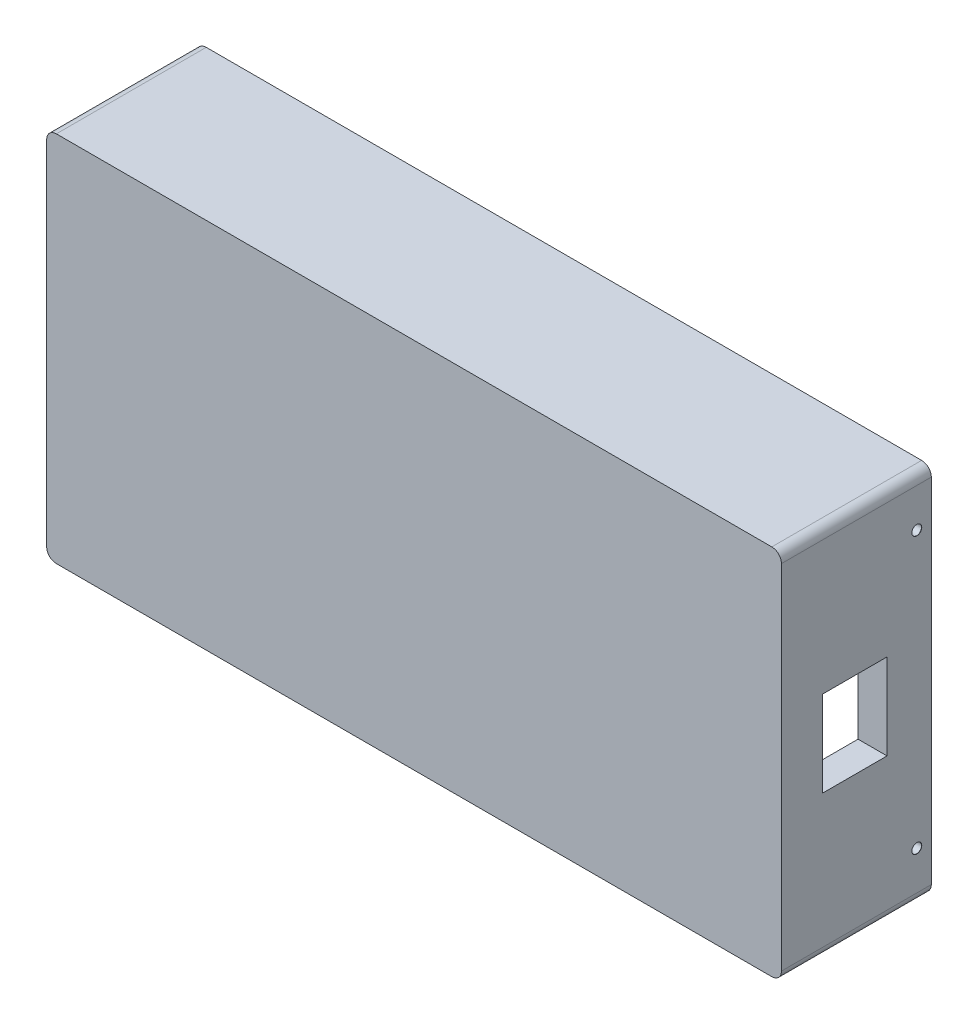
ISO-10303-21;
HEADER;
FILE_DESCRIPTION(('STEP AP214'),'2;1');
FILE_NAME('part.step','',(''),(''),'','','');
FILE_SCHEMA(('AUTOMOTIVE_DESIGN { 1 0 10303 214 1 1 1 1 }'));
ENDSEC;
DATA;
#1=APPLICATION_CONTEXT('core data for automotive mechanical design processes');
#2=APPLICATION_PROTOCOL_DEFINITION('international standard','automotive_design',2000,#1);
#3=PRODUCT_CONTEXT('',#1,'mechanical');
#4=PRODUCT('Part','Part','',(#3));
#5=PRODUCT_RELATED_PRODUCT_CATEGORY('part','',(#4));
#6=PRODUCT_DEFINITION_FORMATION('','',#4);
#7=PRODUCT_DEFINITION_CONTEXT('part definition',#1,'design');
#8=PRODUCT_DEFINITION('design','',#6,#7);
#9=PRODUCT_DEFINITION_SHAPE('','',#8);
#10=(LENGTH_UNIT() NAMED_UNIT(*) SI_UNIT(.MILLI.,.METRE.));
#11=(NAMED_UNIT(*) PLANE_ANGLE_UNIT() SI_UNIT($,.RADIAN.));
#12=(NAMED_UNIT(*) SI_UNIT($,.STERADIAN.) SOLID_ANGLE_UNIT());
#13=UNCERTAINTY_MEASURE_WITH_UNIT(LENGTH_MEASURE(1.E-05),#10,'distance_accuracy_value','');
#14=(GEOMETRIC_REPRESENTATION_CONTEXT(3) GLOBAL_UNCERTAINTY_ASSIGNED_CONTEXT((#13)) GLOBAL_UNIT_ASSIGNED_CONTEXT((#10,
#11,#12)) REPRESENTATION_CONTEXT('',''));
#15=CARTESIAN_POINT('',(0.,0.,0.));
#16=DIRECTION('',(0.,0.,1.));
#17=DIRECTION('',(1.,0.,0.));
#18=AXIS2_PLACEMENT_3D('',#15,#16,#17);
#19=CARTESIAN_POINT('',(-76.,-32.5,25.));
#20=DIRECTION('',(1.,0.,0.));
#21=DIRECTION('',(0.,0.,-1.));
#22=AXIS2_PLACEMENT_3D('',#19,#20,#21);
#23=PLANE('',#22);
#24=DIRECTION('',(0.,-1.,0.));
#25=VECTOR('',#24,1.);
#26=CARTESIAN_POINT('',(-76.,0.,0.));
#27=LINE('',#26,#25);
#28=CARTESIAN_POINT('',(-76.,36.5,0.));
#29=VERTEX_POINT('',#28);
#30=CARTESIAN_POINT('',(-76.,-36.5,0.));
#31=VERTEX_POINT('',#30);
#32=EDGE_CURVE('E250',#29,#31,#27,.T.);
#33=ORIENTED_EDGE('',*,*,#32,.T.);
#34=DIRECTION('',(0.,0.,-1.));
#35=VECTOR('',#34,1.);
#36=CARTESIAN_POINT('',(-76.,-36.5,25.));
#37=LINE('',#36,#35);
#38=CARTESIAN_POINT('',(-76.,-36.5,31.));
#39=VERTEX_POINT('',#38);
#40=EDGE_CURVE('E269',#31,#39,#37,.F.);
#41=ORIENTED_EDGE('',*,*,#40,.T.);
#42=DIRECTION('',(0.,-1.,0.));
#43=VECTOR('',#42,1.);
#44=CARTESIAN_POINT('',(-76.,0.,31.));
#45=LINE('',#44,#43);
#46=CARTESIAN_POINT('',(-76.,36.5,31.));
#47=VERTEX_POINT('',#46);
#48=EDGE_CURVE('E238',#47,#39,#45,.T.);
#49=ORIENTED_EDGE('',*,*,#48,.F.);
#50=DIRECTION('',(0.,0.,-1.));
#51=VECTOR('',#50,1.);
#52=CARTESIAN_POINT('',(-76.,36.5,25.));
#53=LINE('',#52,#51);
#54=EDGE_CURVE('E266',#47,#29,#53,.T.);
#55=ORIENTED_EDGE('',*,*,#54,.T.);
#56=EDGE_LOOP('',(#33,#41,#49,#55));
#57=FACE_BOUND('',#56,.T.);
#58=CARTESIAN_POINT('',(-76.,28.5,3.));
#59=DIRECTION('',(-1.,0.,0.));
#60=DIRECTION('',(0.,0.,1.));
#61=AXIS2_PLACEMENT_3D('',#58,#59,#60);
#62=CIRCLE('',#61,1.025);
#63=CARTESIAN_POINT('',(-76.,28.5,4.025));
#64=VERTEX_POINT('',#63);
#65=EDGE_CURVE('E305',#64,#64,#62,.T.);
#66=ORIENTED_EDGE('',*,*,#65,.F.);
#67=EDGE_LOOP('',(#66));
#68=FACE_BOUND('',#67,.T.);
#69=CARTESIAN_POINT('',(-76.,-28.5,2.99999999999999));
#70=DIRECTION('',(-1.,0.,0.));
#71=DIRECTION('',(0.,0.,1.));
#72=AXIS2_PLACEMENT_3D('',#69,#70,#71);
#73=CIRCLE('',#72,1.025);
#74=CARTESIAN_POINT('',(-76.,-28.5,4.02499999999999));
#75=VERTEX_POINT('',#74);
#76=EDGE_CURVE('E315',#75,#75,#73,.T.);
#77=ORIENTED_EDGE('',*,*,#76,.F.);
#78=EDGE_LOOP('',(#77));
#79=FACE_BOUND('',#78,.T.);
#80=ADVANCED_FACE('F41',(#57,#68,#79),#23,.F.);
#81=CARTESIAN_POINT('',(0.,0.,0.));
#82=DIRECTION('',(0.,0.,-1.));
#83=DIRECTION('',(-1.,0.,0.));
#84=AXIS2_PLACEMENT_3D('',#81,#82,#83);
#85=PLANE('',#84);
#86=DIRECTION('',(1.,0.,0.));
#87=VECTOR('',#86,1.);
#88=CARTESIAN_POINT('',(0.,-38.5,0.));
#89=LINE('',#88,#87);
#90=CARTESIAN_POINT('',(-74.,-38.5,0.));
#91=VERTEX_POINT('',#90);
#92=CARTESIAN_POINT('',(74.,-38.5,0.));
#93=VERTEX_POINT('',#92);
#94=EDGE_CURVE('E236',#91,#93,#89,.T.);
#95=ORIENTED_EDGE('',*,*,#94,.F.);
#96=CARTESIAN_POINT('',(-74.,-36.5,0.));
#97=DIRECTION('',(0.,0.,-1.));
#98=DIRECTION('',(-1.,0.,0.));
#99=AXIS2_PLACEMENT_3D('',#96,#97,#98);
#100=CIRCLE('',#99,2.);
#101=EDGE_CURVE('E264',#91,#31,#100,.T.);
#102=ORIENTED_EDGE('',*,*,#101,.T.);
#103=ORIENTED_EDGE('',*,*,#32,.F.);
#104=CARTESIAN_POINT('',(-74.,36.5,0.));
#105=DIRECTION('',(0.,0.,-1.));
#106=DIRECTION('',(-1.,0.,0.));
#107=AXIS2_PLACEMENT_3D('',#104,#105,#106);
#108=CIRCLE('',#107,2.);
#109=CARTESIAN_POINT('',(-74.,38.5,0.));
#110=VERTEX_POINT('',#109);
#111=EDGE_CURVE('E262',#29,#110,#108,.T.);
#112=ORIENTED_EDGE('',*,*,#111,.T.);
#113=DIRECTION('',(-1.,0.,0.));
#114=VECTOR('',#113,1.);
#115=CARTESIAN_POINT('',(0.,38.5,0.));
#116=LINE('',#115,#114);
#117=CARTESIAN_POINT('',(74.,38.5,0.));
#118=VERTEX_POINT('',#117);
#119=EDGE_CURVE('E247',#118,#110,#116,.T.);
#120=ORIENTED_EDGE('',*,*,#119,.F.);
#121=CARTESIAN_POINT('',(74.,36.5,0.));
#122=DIRECTION('',(0.,0.,-1.));
#123=DIRECTION('',(-1.,0.,0.));
#124=AXIS2_PLACEMENT_3D('',#121,#122,#123);
#125=CIRCLE('',#124,2.);
#126=CARTESIAN_POINT('',(76.,36.5,0.));
#127=VERTEX_POINT('',#126);
#128=EDGE_CURVE('E260',#118,#127,#125,.T.);
#129=ORIENTED_EDGE('',*,*,#128,.T.);
#130=DIRECTION('',(0.,1.,0.));
#131=VECTOR('',#130,1.);
#132=CARTESIAN_POINT('',(76.,0.,0.));
#133=LINE('',#132,#131);
#134=CARTESIAN_POINT('',(76.,-36.5,0.));
#135=VERTEX_POINT('',#134);
#136=EDGE_CURVE('E232',#135,#127,#133,.T.);
#137=ORIENTED_EDGE('',*,*,#136,.F.);
#138=CARTESIAN_POINT('',(74.,-36.5,0.));
#139=DIRECTION('',(0.,0.,-1.));
#140=DIRECTION('',(-1.,0.,0.));
#141=AXIS2_PLACEMENT_3D('',#138,#139,#140);
#142=CIRCLE('',#141,2.);
#143=EDGE_CURVE('E258',#135,#93,#142,.T.);
#144=ORIENTED_EDGE('',*,*,#143,.T.);
#145=EDGE_LOOP('',(#95,#102,#103,#112,#120,#129,#137,#144));
#146=FACE_BOUND('',#145,.T.);
#147=DIRECTION('',(1.,0.,0.));
#148=VECTOR('',#147,1.);
#149=CARTESIAN_POINT('',(-70.,-32.5,0.));
#150=LINE('',#149,#148);
#151=CARTESIAN_POINT('',(-70.,-32.5,0.));
#152=VERTEX_POINT('',#151);
#153=CARTESIAN_POINT('',(70.,-32.5,0.));
#154=VERTEX_POINT('',#153);
#155=EDGE_CURVE('E206',#152,#154,#150,.T.);
#156=ORIENTED_EDGE('',*,*,#155,.T.);
#157=DIRECTION('',(0.,1.,0.));
#158=VECTOR('',#157,1.);
#159=CARTESIAN_POINT('',(70.,-32.5,0.));
#160=LINE('',#159,#158);
#161=CARTESIAN_POINT('',(70.,32.5,0.));
#162=VERTEX_POINT('',#161);
#163=EDGE_CURVE('E201',#154,#162,#160,.T.);
#164=ORIENTED_EDGE('',*,*,#163,.T.);
#165=DIRECTION('',(-1.,0.,0.));
#166=VECTOR('',#165,1.);
#167=CARTESIAN_POINT('',(-70.,32.5,0.));
#168=LINE('',#167,#166);
#169=CARTESIAN_POINT('',(-70.,32.5,0.));
#170=VERTEX_POINT('',#169);
#171=EDGE_CURVE('E215',#162,#170,#168,.T.);
#172=ORIENTED_EDGE('',*,*,#171,.T.);
#173=DIRECTION('',(0.,-1.,0.));
#174=VECTOR('',#173,1.);
#175=CARTESIAN_POINT('',(-70.,-32.5,0.));
#176=LINE('',#175,#174);
#177=EDGE_CURVE('E218',#170,#152,#176,.T.);
#178=ORIENTED_EDGE('',*,*,#177,.T.);
#179=EDGE_LOOP('',(#156,#164,#172,#178));
#180=FACE_BOUND('',#179,.T.);
#181=ADVANCED_FACE('F329',(#146,#180),#85,.T.);
#182=CARTESIAN_POINT('',(76.,-32.5,25.));
#183=DIRECTION('',(-1.,0.,0.));
#184=DIRECTION('',(0.,0.,1.));
#185=AXIS2_PLACEMENT_3D('',#182,#183,#184);
#186=PLANE('',#185);
#187=CARTESIAN_POINT('',(76.,-28.5,3.));
#188=DIRECTION('',(1.,0.,0.));
#189=DIRECTION('',(0.,0.,-1.));
#190=AXIS2_PLACEMENT_3D('',#187,#188,#189);
#191=CIRCLE('',#190,1.025);
#192=CARTESIAN_POINT('',(76.,-28.5,1.975));
#193=VERTEX_POINT('',#192);
#194=EDGE_CURVE('E302',#193,#193,#191,.T.);
#195=ORIENTED_EDGE('',*,*,#194,.F.);
#196=EDGE_LOOP('',(#195));
#197=FACE_BOUND('',#196,.T.);
#198=CARTESIAN_POINT('',(76.,28.5,3.));
#199=DIRECTION('',(1.,0.,0.));
#200=DIRECTION('',(0.,0.,-1.));
#201=AXIS2_PLACEMENT_3D('',#198,#199,#200);
#202=CIRCLE('',#201,1.025);
#203=CARTESIAN_POINT('',(76.,28.5,1.975));
#204=VERTEX_POINT('',#203);
#205=EDGE_CURVE('E299',#204,#204,#202,.T.);
#206=ORIENTED_EDGE('',*,*,#205,.F.);
#207=EDGE_LOOP('',(#206));
#208=FACE_BOUND('',#207,.T.);
#209=DIRECTION('',(0.,0.,1.));
#210=VECTOR('',#209,1.);
#211=CARTESIAN_POINT('',(76.,-8.87036347979733,25.));
#212=LINE('',#211,#210);
#213=CARTESIAN_POINT('',(76.,-8.87036347979733,9.15634611747794));
#214=VERTEX_POINT('',#213);
#215=CARTESIAN_POINT('',(76.,-8.87036347979733,22.4887712265074));
#216=VERTEX_POINT('',#215);
#217=EDGE_CURVE('E195',#214,#216,#212,.T.);
#218=ORIENTED_EDGE('',*,*,#217,.T.);
#219=DIRECTION('',(0.,1.,0.));
#220=VECTOR('',#219,1.);
#221=CARTESIAN_POINT('',(76.,-32.5,22.4887712265074));
#222=LINE('',#221,#220);
#223=CARTESIAN_POINT('',(76.,8.87036347979733,22.4887712265074));
#224=VERTEX_POINT('',#223);
#225=EDGE_CURVE('E198',#216,#224,#222,.T.);
#226=ORIENTED_EDGE('',*,*,#225,.T.);
#227=DIRECTION('',(0.,0.,-1.));
#228=VECTOR('',#227,1.);
#229=CARTESIAN_POINT('',(76.,8.87036347979733,25.));
#230=LINE('',#229,#228);
#231=CARTESIAN_POINT('',(76.,8.87036347979733,9.15634611747794));
#232=VERTEX_POINT('',#231);
#233=EDGE_CURVE('E190',#224,#232,#230,.T.);
#234=ORIENTED_EDGE('',*,*,#233,.T.);
#235=DIRECTION('',(0.,-1.,0.));
#236=VECTOR('',#235,1.);
#237=CARTESIAN_POINT('',(76.,-32.5,9.15634611747794));
#238=LINE('',#237,#236);
#239=EDGE_CURVE('E165',#232,#214,#238,.T.);
#240=ORIENTED_EDGE('',*,*,#239,.T.);
#241=EDGE_LOOP('',(#218,#226,#234,#240));
#242=FACE_BOUND('',#241,.T.);
#243=ORIENTED_EDGE('',*,*,#136,.T.);
#244=DIRECTION('',(0.,0.,-1.));
#245=VECTOR('',#244,1.);
#246=CARTESIAN_POINT('',(76.,36.5,25.));
#247=LINE('',#246,#245);
#248=CARTESIAN_POINT('',(76.,36.5,31.));
#249=VERTEX_POINT('',#248);
#250=EDGE_CURVE('E11',#127,#249,#247,.F.);
#251=ORIENTED_EDGE('',*,*,#250,.T.);
#252=DIRECTION('',(0.,1.,0.));
#253=VECTOR('',#252,1.);
#254=CARTESIAN_POINT('',(76.,0.,31.));
#255=LINE('',#254,#253);
#256=CARTESIAN_POINT('',(76.,-36.5,31.));
#257=VERTEX_POINT('',#256);
#258=EDGE_CURVE('E233',#257,#249,#255,.T.);
#259=ORIENTED_EDGE('',*,*,#258,.F.);
#260=DIRECTION('',(0.,0.,-1.));
#261=VECTOR('',#260,1.);
#262=CARTESIAN_POINT('',(76.,-36.5,25.));
#263=LINE('',#262,#261);
#264=EDGE_CURVE('E50',#257,#135,#263,.T.);
#265=ORIENTED_EDGE('',*,*,#264,.T.);
#266=EDGE_LOOP('',(#243,#251,#259,#265));
#267=FACE_BOUND('',#266,.T.);
#268=ADVANCED_FACE('F325',(#197,#208,#242,#267),#186,.F.);
#269=CARTESIAN_POINT('',(-70.,38.5,25.));
#270=DIRECTION('',(0.,-1.,0.));
#271=DIRECTION('',(0.,0.,-1.));
#272=AXIS2_PLACEMENT_3D('',#269,#270,#271);
#273=PLANE('',#272);
#274=ORIENTED_EDGE('',*,*,#119,.T.);
#275=DIRECTION('',(0.,0.,-1.));
#276=VECTOR('',#275,1.);
#277=CARTESIAN_POINT('',(-74.,38.5,25.));
#278=LINE('',#277,#276);
#279=CARTESIAN_POINT('',(-74.,38.5,31.));
#280=VERTEX_POINT('',#279);
#281=EDGE_CURVE('E58',#110,#280,#278,.F.);
#282=ORIENTED_EDGE('',*,*,#281,.T.);
#283=DIRECTION('',(-1.,0.,0.));
#284=VECTOR('',#283,1.);
#285=CARTESIAN_POINT('',(0.,38.5,31.));
#286=LINE('',#285,#284);
#287=CARTESIAN_POINT('',(74.,38.5,31.));
#288=VERTEX_POINT('',#287);
#289=EDGE_CURVE('E235',#288,#280,#286,.T.);
#290=ORIENTED_EDGE('',*,*,#289,.F.);
#291=DIRECTION('',(0.,0.,-1.));
#292=VECTOR('',#291,1.);
#293=CARTESIAN_POINT('',(74.,38.5,25.));
#294=LINE('',#293,#292);
#295=EDGE_CURVE('E278',#288,#118,#294,.T.);
#296=ORIENTED_EDGE('',*,*,#295,.T.);
#297=EDGE_LOOP('',(#274,#282,#290,#296));
#298=FACE_BOUND('',#297,.T.);
#299=ADVANCED_FACE('F328',(#298),#273,.F.);
#300=CARTESIAN_POINT('',(-70.,-38.5,25.));
#301=DIRECTION('',(0.,1.,0.));
#302=DIRECTION('',(0.,0.,1.));
#303=AXIS2_PLACEMENT_3D('',#300,#301,#302);
#304=PLANE('',#303);
#305=DIRECTION('',(1.,0.,0.));
#306=VECTOR('',#305,1.);
#307=CARTESIAN_POINT('',(0.,-38.5,31.));
#308=LINE('',#307,#306);
#309=CARTESIAN_POINT('',(-74.,-38.5,31.));
#310=VERTEX_POINT('',#309);
#311=CARTESIAN_POINT('',(74.,-38.5,31.));
#312=VERTEX_POINT('',#311);
#313=EDGE_CURVE('E241',#310,#312,#308,.T.);
#314=ORIENTED_EDGE('',*,*,#313,.F.);
#315=DIRECTION('',(0.,0.,-1.));
#316=VECTOR('',#315,1.);
#317=CARTESIAN_POINT('',(-74.,-38.5,25.));
#318=LINE('',#317,#316);
#319=EDGE_CURVE('E255',#310,#91,#318,.T.);
#320=ORIENTED_EDGE('',*,*,#319,.T.);
#321=ORIENTED_EDGE('',*,*,#94,.T.);
#322=DIRECTION('',(0.,0.,-1.));
#323=VECTOR('',#322,1.);
#324=CARTESIAN_POINT('',(74.,-38.5,25.));
#325=LINE('',#324,#323);
#326=EDGE_CURVE('E244',#93,#312,#325,.F.);
#327=ORIENTED_EDGE('',*,*,#326,.T.);
#328=EDGE_LOOP('',(#314,#320,#321,#327));
#329=FACE_BOUND('',#328,.T.);
#330=ADVANCED_FACE('F359',(#329),#304,.F.);
#331=CARTESIAN_POINT('',(0.,0.,31.));
#332=DIRECTION('',(0.,0.,-1.));
#333=DIRECTION('',(-1.,0.,0.));
#334=AXIS2_PLACEMENT_3D('',#331,#332,#333);
#335=PLANE('',#334);
#336=ORIENTED_EDGE('',*,*,#48,.T.);
#337=CARTESIAN_POINT('',(-74.,-36.5,31.));
#338=DIRECTION('',(0.,0.,-1.));
#339=DIRECTION('',(-1.,0.,0.));
#340=AXIS2_PLACEMENT_3D('',#337,#338,#339);
#341=CIRCLE('',#340,2.);
#342=EDGE_CURVE('E276',#39,#310,#341,.F.);
#343=ORIENTED_EDGE('',*,*,#342,.T.);
#344=ORIENTED_EDGE('',*,*,#313,.T.);
#345=CARTESIAN_POINT('',(74.,-36.5,31.));
#346=DIRECTION('',(0.,0.,-1.));
#347=DIRECTION('',(-1.,0.,0.));
#348=AXIS2_PLACEMENT_3D('',#345,#346,#347);
#349=CIRCLE('',#348,2.);
#350=EDGE_CURVE('E271',#312,#257,#349,.F.);
#351=ORIENTED_EDGE('',*,*,#350,.T.);
#352=ORIENTED_EDGE('',*,*,#258,.T.);
#353=CARTESIAN_POINT('',(74.,36.5,31.));
#354=DIRECTION('',(0.,0.,-1.));
#355=DIRECTION('',(-1.,0.,0.));
#356=AXIS2_PLACEMENT_3D('',#353,#354,#355);
#357=CIRCLE('',#356,2.);
#358=EDGE_CURVE('E65',#249,#288,#357,.F.);
#359=ORIENTED_EDGE('',*,*,#358,.T.);
#360=ORIENTED_EDGE('',*,*,#289,.T.);
#361=CARTESIAN_POINT('',(-74.,36.5,31.));
#362=DIRECTION('',(0.,0.,-1.));
#363=DIRECTION('',(-1.,0.,0.));
#364=AXIS2_PLACEMENT_3D('',#361,#362,#363);
#365=CIRCLE('',#364,2.);
#366=EDGE_CURVE('E274',#280,#47,#365,.F.);
#367=ORIENTED_EDGE('',*,*,#366,.T.);
#368=EDGE_LOOP('',(#336,#343,#344,#351,#352,#359,#360,#367));
#369=FACE_BOUND('',#368,.T.);
#370=ADVANCED_FACE('F353',(#369),#335,.F.);
#371=CARTESIAN_POINT('',(70.,-32.5,25.));
#372=DIRECTION('',(-1.,0.,0.));
#373=DIRECTION('',(0.,0.,1.));
#374=AXIS2_PLACEMENT_3D('',#371,#372,#373);
#375=PLANE('',#374);
#376=CARTESIAN_POINT('',(70.,-28.5,3.));
#377=DIRECTION('',(-1.,0.,0.));
#378=DIRECTION('',(0.,0.,1.));
#379=AXIS2_PLACEMENT_3D('',#376,#377,#378);
#380=CIRCLE('',#379,1.);
#381=CARTESIAN_POINT('',(70.,-28.5,4.));
#382=VERTEX_POINT('',#381);
#383=EDGE_CURVE('E287',#382,#382,#380,.T.);
#384=ORIENTED_EDGE('',*,*,#383,.F.);
#385=EDGE_LOOP('',(#384));
#386=FACE_BOUND('',#385,.T.);
#387=CARTESIAN_POINT('',(70.,28.5,3.));
#388=DIRECTION('',(-1.,0.,0.));
#389=DIRECTION('',(0.,0.,1.));
#390=AXIS2_PLACEMENT_3D('',#387,#388,#389);
#391=CIRCLE('',#390,1.);
#392=CARTESIAN_POINT('',(70.,28.5,4.));
#393=VERTEX_POINT('',#392);
#394=EDGE_CURVE('E284',#393,#393,#391,.T.);
#395=ORIENTED_EDGE('',*,*,#394,.F.);
#396=EDGE_LOOP('',(#395));
#397=FACE_BOUND('',#396,.T.);
#398=DIRECTION('',(0.,1.,0.));
#399=VECTOR('',#398,1.);
#400=CARTESIAN_POINT('',(70.,-8.87036347979733,22.4887712265074));
#401=LINE('',#400,#399);
#402=CARTESIAN_POINT('',(70.,-8.87036347979733,22.4887712265074));
#403=VERTEX_POINT('',#402);
#404=CARTESIAN_POINT('',(70.,8.87036347979733,22.4887712265074));
#405=VERTEX_POINT('',#404);
#406=EDGE_CURVE('E178',#403,#405,#401,.T.);
#407=ORIENTED_EDGE('',*,*,#406,.F.);
#408=DIRECTION('',(0.,0.,1.));
#409=VECTOR('',#408,1.);
#410=CARTESIAN_POINT('',(70.,-8.87036347979733,9.15634611747794));
#411=LINE('',#410,#409);
#412=CARTESIAN_POINT('',(70.,-8.87036347979733,9.15634611747794));
#413=VERTEX_POINT('',#412);
#414=EDGE_CURVE('E183',#413,#403,#411,.T.);
#415=ORIENTED_EDGE('',*,*,#414,.F.);
#416=DIRECTION('',(0.,-1.,0.));
#417=VECTOR('',#416,1.);
#418=CARTESIAN_POINT('',(70.,-8.87036347979733,9.15634611747794));
#419=LINE('',#418,#417);
#420=CARTESIAN_POINT('',(70.,8.87036347979733,9.15634611747794));
#421=VERTEX_POINT('',#420);
#422=EDGE_CURVE('E162',#421,#413,#419,.T.);
#423=ORIENTED_EDGE('',*,*,#422,.F.);
#424=DIRECTION('',(0.,0.,-1.));
#425=VECTOR('',#424,1.);
#426=CARTESIAN_POINT('',(70.,8.87036347979733,9.15634611747794));
#427=LINE('',#426,#425);
#428=EDGE_CURVE('E173',#405,#421,#427,.T.);
#429=ORIENTED_EDGE('',*,*,#428,.F.);
#430=EDGE_LOOP('',(#407,#415,#423,#429));
#431=FACE_BOUND('',#430,.T.);
#432=ORIENTED_EDGE('',*,*,#163,.F.);
#433=DIRECTION('',(0.,0.,-1.));
#434=VECTOR('',#433,1.);
#435=CARTESIAN_POINT('',(70.,-32.5,25.));
#436=LINE('',#435,#434);
#437=CARTESIAN_POINT('',(70.,-32.5,25.));
#438=VERTEX_POINT('',#437);
#439=EDGE_CURVE('E212',#438,#154,#436,.T.);
#440=ORIENTED_EDGE('',*,*,#439,.F.);
#441=DIRECTION('',(0.,1.,0.));
#442=VECTOR('',#441,1.);
#443=CARTESIAN_POINT('',(70.,-32.5,25.));
#444=LINE('',#443,#442);
#445=CARTESIAN_POINT('',(70.,32.5,25.));
#446=VERTEX_POINT('',#445);
#447=EDGE_CURVE('E202',#438,#446,#444,.T.);
#448=ORIENTED_EDGE('',*,*,#447,.T.);
#449=DIRECTION('',(0.,0.,-1.));
#450=VECTOR('',#449,1.);
#451=CARTESIAN_POINT('',(70.,32.5,25.));
#452=LINE('',#451,#450);
#453=EDGE_CURVE('E229',#446,#162,#452,.T.);
#454=ORIENTED_EDGE('',*,*,#453,.T.);
#455=EDGE_LOOP('',(#432,#440,#448,#454));
#456=FACE_BOUND('',#455,.T.);
#457=ADVANCED_FACE('F180',(#386,#397,#431,#456),#375,.T.);
#458=CARTESIAN_POINT('',(-70.,32.5,25.));
#459=DIRECTION('',(0.,-1.,0.));
#460=DIRECTION('',(0.,0.,-1.));
#461=AXIS2_PLACEMENT_3D('',#458,#459,#460);
#462=PLANE('',#461);
#463=ORIENTED_EDGE('',*,*,#171,.F.);
#464=ORIENTED_EDGE('',*,*,#453,.F.);
#465=DIRECTION('',(-1.,0.,0.));
#466=VECTOR('',#465,1.);
#467=CARTESIAN_POINT('',(-70.,32.5,25.));
#468=LINE('',#467,#466);
#469=CARTESIAN_POINT('',(-70.,32.5,25.));
#470=VERTEX_POINT('',#469);
#471=EDGE_CURVE('E205',#446,#470,#468,.T.);
#472=ORIENTED_EDGE('',*,*,#471,.T.);
#473=DIRECTION('',(0.,0.,-1.));
#474=VECTOR('',#473,1.);
#475=CARTESIAN_POINT('',(-70.,32.5,25.));
#476=LINE('',#475,#474);
#477=EDGE_CURVE('E226',#470,#170,#476,.T.);
#478=ORIENTED_EDGE('',*,*,#477,.T.);
#479=EDGE_LOOP('',(#463,#464,#472,#478));
#480=FACE_BOUND('',#479,.T.);
#481=ADVANCED_FACE('F421',(#480),#462,.T.);
#482=CARTESIAN_POINT('',(-70.,-32.5,25.));
#483=DIRECTION('',(1.,0.,0.));
#484=DIRECTION('',(0.,0.,-1.));
#485=AXIS2_PLACEMENT_3D('',#482,#483,#484);
#486=PLANE('',#485);
#487=CARTESIAN_POINT('',(-70.,-28.5,2.99999999999999));
#488=DIRECTION('',(1.,0.,0.));
#489=DIRECTION('',(0.,0.,-1.));
#490=AXIS2_PLACEMENT_3D('',#487,#488,#489);
#491=CIRCLE('',#490,1.);
#492=CARTESIAN_POINT('',(-70.,-28.5,1.99999999999999));
#493=VERTEX_POINT('',#492);
#494=EDGE_CURVE('E288',#493,#493,#491,.T.);
#495=ORIENTED_EDGE('',*,*,#494,.F.);
#496=EDGE_LOOP('',(#495));
#497=FACE_BOUND('',#496,.T.);
#498=CARTESIAN_POINT('',(-70.,28.5,3.));
#499=DIRECTION('',(1.,0.,0.));
#500=DIRECTION('',(0.,0.,-1.));
#501=AXIS2_PLACEMENT_3D('',#498,#499,#500);
#502=CIRCLE('',#501,1.);
#503=CARTESIAN_POINT('',(-70.,28.5,2.));
#504=VERTEX_POINT('',#503);
#505=EDGE_CURVE('E291',#504,#504,#502,.T.);
#506=ORIENTED_EDGE('',*,*,#505,.F.);
#507=EDGE_LOOP('',(#506));
#508=FACE_BOUND('',#507,.T.);
#509=ORIENTED_EDGE('',*,*,#177,.F.);
#510=ORIENTED_EDGE('',*,*,#477,.F.);
#511=DIRECTION('',(0.,-1.,0.));
#512=VECTOR('',#511,1.);
#513=CARTESIAN_POINT('',(-70.,-32.5,25.));
#514=LINE('',#513,#512);
#515=CARTESIAN_POINT('',(-70.,-32.5,25.));
#516=VERTEX_POINT('',#515);
#517=EDGE_CURVE('E208',#470,#516,#514,.T.);
#518=ORIENTED_EDGE('',*,*,#517,.T.);
#519=DIRECTION('',(0.,0.,-1.));
#520=VECTOR('',#519,1.);
#521=CARTESIAN_POINT('',(-70.,-32.5,25.));
#522=LINE('',#521,#520);
#523=EDGE_CURVE('E224',#516,#152,#522,.T.);
#524=ORIENTED_EDGE('',*,*,#523,.T.);
#525=EDGE_LOOP('',(#509,#510,#518,#524));
#526=FACE_BOUND('',#525,.T.);
#527=ADVANCED_FACE('F427',(#497,#508,#526),#486,.T.);
#528=CARTESIAN_POINT('',(-70.,-32.5,25.));
#529=DIRECTION('',(0.,1.,0.));
#530=DIRECTION('',(0.,0.,1.));
#531=AXIS2_PLACEMENT_3D('',#528,#529,#530);
#532=PLANE('',#531);
#533=ORIENTED_EDGE('',*,*,#155,.F.);
#534=ORIENTED_EDGE('',*,*,#523,.F.);
#535=DIRECTION('',(1.,0.,0.));
#536=VECTOR('',#535,1.);
#537=CARTESIAN_POINT('',(-70.,-32.5,25.));
#538=LINE('',#537,#536);
#539=EDGE_CURVE('E210',#516,#438,#538,.T.);
#540=ORIENTED_EDGE('',*,*,#539,.T.);
#541=ORIENTED_EDGE('',*,*,#439,.T.);
#542=EDGE_LOOP('',(#533,#534,#540,#541));
#543=FACE_BOUND('',#542,.T.);
#544=ADVANCED_FACE('F431',(#543),#532,.T.);
#545=CARTESIAN_POINT('',(0.,0.,25.));
#546=DIRECTION('',(0.,0.,-1.));
#547=DIRECTION('',(-1.,0.,0.));
#548=AXIS2_PLACEMENT_3D('',#545,#546,#547);
#549=PLANE('',#548);
#550=ORIENTED_EDGE('',*,*,#447,.F.);
#551=ORIENTED_EDGE('',*,*,#539,.F.);
#552=ORIENTED_EDGE('',*,*,#517,.F.);
#553=ORIENTED_EDGE('',*,*,#471,.F.);
#554=EDGE_LOOP('',(#550,#551,#552,#553));
#555=FACE_BOUND('',#554,.T.);
#556=ADVANCED_FACE('F560',(#555),#549,.T.);
#557=CARTESIAN_POINT('',(95.,-8.87036347979733,22.4887712265074));
#558=DIRECTION('',(0.,0.,1.));
#559=DIRECTION('',(1.,0.,0.));
#560=AXIS2_PLACEMENT_3D('',#557,#558,#559);
#561=PLANE('',#560);
#562=DIRECTION('',(-1.,0.,0.));
#563=VECTOR('',#562,1.);
#564=CARTESIAN_POINT('',(95.,-8.87036347979733,22.4887712265074));
#565=LINE('',#564,#563);
#566=EDGE_CURVE('E188',#216,#403,#565,.T.);
#567=ORIENTED_EDGE('',*,*,#566,.T.);
#568=ORIENTED_EDGE('',*,*,#406,.T.);
#569=DIRECTION('',(-1.,0.,0.));
#570=VECTOR('',#569,1.);
#571=CARTESIAN_POINT('',(95.,8.87036347979733,22.4887712265074));
#572=LINE('',#571,#570);
#573=EDGE_CURVE('E169',#224,#405,#572,.T.);
#574=ORIENTED_EDGE('',*,*,#573,.F.);
#575=ORIENTED_EDGE('',*,*,#225,.F.);
#576=EDGE_LOOP('',(#567,#568,#574,#575));
#577=FACE_BOUND('',#576,.T.);
#578=ADVANCED_FACE('F320',(#577),#561,.F.);
#579=CARTESIAN_POINT('',(95.,-8.87036347979733,9.15634611747794));
#580=DIRECTION('',(0.,-1.,0.));
#581=DIRECTION('',(0.,0.,-1.));
#582=AXIS2_PLACEMENT_3D('',#579,#580,#581);
#583=PLANE('',#582);
#584=DIRECTION('',(-1.,0.,0.));
#585=VECTOR('',#584,1.);
#586=CARTESIAN_POINT('',(95.,-8.87036347979733,9.15634611747794));
#587=LINE('',#586,#585);
#588=EDGE_CURVE('E168',#214,#413,#587,.T.);
#589=ORIENTED_EDGE('',*,*,#588,.T.);
#590=ORIENTED_EDGE('',*,*,#414,.T.);
#591=ORIENTED_EDGE('',*,*,#566,.F.);
#592=ORIENTED_EDGE('',*,*,#217,.F.);
#593=EDGE_LOOP('',(#589,#590,#591,#592));
#594=FACE_BOUND('',#593,.T.);
#595=ADVANCED_FACE('F323',(#594),#583,.F.);
#596=CARTESIAN_POINT('',(95.,-8.87036347979733,9.15634611747794));
#597=DIRECTION('',(0.,0.,-1.));
#598=DIRECTION('',(-1.,0.,0.));
#599=AXIS2_PLACEMENT_3D('',#596,#597,#598);
#600=PLANE('',#599);
#601=DIRECTION('',(-1.,0.,0.));
#602=VECTOR('',#601,1.);
#603=CARTESIAN_POINT('',(95.,8.87036347979733,9.15634611747794));
#604=LINE('',#603,#602);
#605=EDGE_CURVE('E157',#232,#421,#604,.T.);
#606=ORIENTED_EDGE('',*,*,#605,.T.);
#607=ORIENTED_EDGE('',*,*,#422,.T.);
#608=ORIENTED_EDGE('',*,*,#588,.F.);
#609=ORIENTED_EDGE('',*,*,#239,.F.);
#610=EDGE_LOOP('',(#606,#607,#608,#609));
#611=FACE_BOUND('',#610,.T.);
#612=ADVANCED_FACE('F159',(#611),#600,.F.);
#613=CARTESIAN_POINT('',(95.,8.87036347979733,9.15634611747794));
#614=DIRECTION('',(0.,1.,0.));
#615=DIRECTION('',(0.,0.,1.));
#616=AXIS2_PLACEMENT_3D('',#613,#614,#615);
#617=PLANE('',#616);
#618=ORIENTED_EDGE('',*,*,#573,.T.);
#619=ORIENTED_EDGE('',*,*,#428,.T.);
#620=ORIENTED_EDGE('',*,*,#605,.F.);
#621=ORIENTED_EDGE('',*,*,#233,.F.);
#622=EDGE_LOOP('',(#618,#619,#620,#621));
#623=FACE_BOUND('',#622,.T.);
#624=ADVANCED_FACE('F174',(#623),#617,.F.);
#625=CARTESIAN_POINT('',(-74.,-36.5,25.));
#626=DIRECTION('',(0.,0.,-1.));
#627=DIRECTION('',(-1.,0.,0.));
#628=AXIS2_PLACEMENT_3D('',#625,#626,#627);
#629=CYLINDRICAL_SURFACE('',#628,2.);
#630=ORIENTED_EDGE('',*,*,#342,.F.);
#631=ORIENTED_EDGE('',*,*,#40,.F.);
#632=ORIENTED_EDGE('',*,*,#101,.F.);
#633=ORIENTED_EDGE('',*,*,#319,.F.);
#634=EDGE_LOOP('',(#630,#631,#632,#633));
#635=FACE_BOUND('',#634,.T.);
#636=ADVANCED_FACE('F357',(#635),#629,.T.);
#637=CARTESIAN_POINT('',(-74.,36.5,25.));
#638=DIRECTION('',(0.,0.,-1.));
#639=DIRECTION('',(-1.,0.,0.));
#640=AXIS2_PLACEMENT_3D('',#637,#638,#639);
#641=CYLINDRICAL_SURFACE('',#640,2.);
#642=ORIENTED_EDGE('',*,*,#366,.F.);
#643=ORIENTED_EDGE('',*,*,#281,.F.);
#644=ORIENTED_EDGE('',*,*,#111,.F.);
#645=ORIENTED_EDGE('',*,*,#54,.F.);
#646=EDGE_LOOP('',(#642,#643,#644,#645));
#647=FACE_BOUND('',#646,.T.);
#648=ADVANCED_FACE('F347',(#647),#641,.T.);
#649=CARTESIAN_POINT('',(74.,36.5,25.));
#650=DIRECTION('',(0.,0.,-1.));
#651=DIRECTION('',(-1.,0.,0.));
#652=AXIS2_PLACEMENT_3D('',#649,#650,#651);
#653=CYLINDRICAL_SURFACE('',#652,2.);
#654=ORIENTED_EDGE('',*,*,#358,.F.);
#655=ORIENTED_EDGE('',*,*,#250,.F.);
#656=ORIENTED_EDGE('',*,*,#128,.F.);
#657=ORIENTED_EDGE('',*,*,#295,.F.);
#658=EDGE_LOOP('',(#654,#655,#656,#657));
#659=FACE_BOUND('',#658,.T.);
#660=ADVANCED_FACE('F338',(#659),#653,.T.);
#661=CARTESIAN_POINT('',(74.,-36.5,25.));
#662=DIRECTION('',(0.,0.,-1.));
#663=DIRECTION('',(-1.,0.,0.));
#664=AXIS2_PLACEMENT_3D('',#661,#662,#663);
#665=CYLINDRICAL_SURFACE('',#664,2.);
#666=ORIENTED_EDGE('',*,*,#350,.F.);
#667=ORIENTED_EDGE('',*,*,#326,.F.);
#668=ORIENTED_EDGE('',*,*,#143,.F.);
#669=ORIENTED_EDGE('',*,*,#264,.F.);
#670=EDGE_LOOP('',(#666,#667,#668,#669));
#671=FACE_BOUND('',#670,.T.);
#672=ADVANCED_FACE('F43',(#671),#665,.T.);
#673=CARTESIAN_POINT('',(56.,28.5,3.));
#674=DIRECTION('',(1.,0.,0.));
#675=DIRECTION('',(0.,0.,-1.));
#676=AXIS2_PLACEMENT_3D('',#673,#674,#675);
#677=CYLINDRICAL_SURFACE('',#676,1.);
#678=CARTESIAN_POINT('',(75.9712407898195,28.5,3.));
#679=DIRECTION('',(1.,0.,0.));
#680=DIRECTION('',(0.,0.,-1.));
#681=AXIS2_PLACEMENT_3D('',#678,#679,#680);
#682=CIRCLE('',#681,1.);
#683=CARTESIAN_POINT('',(75.9712407898195,28.5,2.));
#684=VERTEX_POINT('',#683);
#685=EDGE_CURVE('E294',#684,#684,#682,.T.);
#686=ORIENTED_EDGE('',*,*,#685,.T.);
#687=EDGE_LOOP('',(#686));
#688=FACE_BOUND('',#687,.T.);
#689=ORIENTED_EDGE('',*,*,#394,.T.);
#690=EDGE_LOOP('',(#689));
#691=FACE_BOUND('',#690,.T.);
#692=ADVANCED_FACE('F364',(#688,#691),#677,.F.);
#693=CARTESIAN_POINT('',(56.,-28.5,3.));
#694=DIRECTION('',(1.,0.,0.));
#695=DIRECTION('',(0.,0.,-1.));
#696=AXIS2_PLACEMENT_3D('',#693,#694,#695);
#697=CYLINDRICAL_SURFACE('',#696,1.);
#698=CARTESIAN_POINT('',(75.9712407898195,-28.5,3.));
#699=DIRECTION('',(1.,0.,0.));
#700=DIRECTION('',(0.,0.,-1.));
#701=AXIS2_PLACEMENT_3D('',#698,#699,#700);
#702=CIRCLE('',#701,1.);
#703=CARTESIAN_POINT('',(75.9712407898195,-28.5,2.));
#704=VERTEX_POINT('',#703);
#705=EDGE_CURVE('E300',#704,#704,#702,.T.);
#706=ORIENTED_EDGE('',*,*,#705,.T.);
#707=EDGE_LOOP('',(#706));
#708=FACE_BOUND('',#707,.T.);
#709=ORIENTED_EDGE('',*,*,#383,.T.);
#710=EDGE_LOOP('',(#709));
#711=FACE_BOUND('',#710,.T.);
#712=ADVANCED_FACE('F370',(#708,#711),#697,.F.);
#713=CARTESIAN_POINT('',(-56.,28.5,3.));
#714=DIRECTION('',(-1.,0.,0.));
#715=DIRECTION('',(0.,0.,1.));
#716=AXIS2_PLACEMENT_3D('',#713,#714,#715);
#717=CYLINDRICAL_SURFACE('',#716,1.);
#718=CARTESIAN_POINT('',(-75.9712407898195,28.5,3.));
#719=DIRECTION('',(-1.,0.,0.));
#720=DIRECTION('',(0.,0.,1.));
#721=AXIS2_PLACEMENT_3D('',#718,#719,#720);
#722=CIRCLE('',#721,1.);
#723=CARTESIAN_POINT('',(-75.9712407898195,28.5,4.));
#724=VERTEX_POINT('',#723);
#725=EDGE_CURVE('E303',#724,#724,#722,.T.);
#726=ORIENTED_EDGE('',*,*,#725,.T.);
#727=EDGE_LOOP('',(#726));
#728=FACE_BOUND('',#727,.T.);
#729=ORIENTED_EDGE('',*,*,#505,.T.);
#730=EDGE_LOOP('',(#729));
#731=FACE_BOUND('',#730,.T.);
#732=ADVANCED_FACE('F466',(#728,#731),#717,.F.);
#733=CARTESIAN_POINT('',(-56.,-28.5,2.99999999999999));
#734=DIRECTION('',(-1.,0.,0.));
#735=DIRECTION('',(0.,0.,1.));
#736=AXIS2_PLACEMENT_3D('',#733,#734,#735);
#737=CYLINDRICAL_SURFACE('',#736,1.);
#738=CARTESIAN_POINT('',(-75.9712407898195,-28.5,2.99999999999999));
#739=DIRECTION('',(-1.,0.,0.));
#740=DIRECTION('',(0.,0.,1.));
#741=AXIS2_PLACEMENT_3D('',#738,#739,#740);
#742=CIRCLE('',#741,1.);
#743=CARTESIAN_POINT('',(-75.9712407898195,-28.5,3.99999999999999));
#744=VERTEX_POINT('',#743);
#745=EDGE_CURVE('E45',#744,#744,#742,.T.);
#746=ORIENTED_EDGE('',*,*,#745,.T.);
#747=EDGE_LOOP('',(#746));
#748=FACE_BOUND('',#747,.T.);
#749=ORIENTED_EDGE('',*,*,#494,.T.);
#750=EDGE_LOOP('',(#749));
#751=FACE_BOUND('',#750,.T.);
#752=ADVANCED_FACE('F477',(#748,#751),#737,.F.);
#753=CARTESIAN_POINT('',(76.,28.5,3.));
#754=DIRECTION('',(1.,0.,0.));
#755=DIRECTION('',(0.,0.,-1.));
#756=AXIS2_PLACEMENT_3D('',#753,#754,#755);
#757=CONICAL_SURFACE('',#756,1.025,0.715584993317694);
#758=ORIENTED_EDGE('',*,*,#205,.T.);
#759=EDGE_LOOP('',(#758));
#760=FACE_BOUND('',#759,.T.);
#761=ORIENTED_EDGE('',*,*,#685,.F.);
#762=EDGE_LOOP('',(#761));
#763=FACE_BOUND('',#762,.T.);
#764=ADVANCED_FACE('F487',(#760,#763),#757,.F.);
#765=CARTESIAN_POINT('',(76.,-28.5,3.));
#766=DIRECTION('',(1.,0.,0.));
#767=DIRECTION('',(0.,0.,-1.));
#768=AXIS2_PLACEMENT_3D('',#765,#766,#767);
#769=CONICAL_SURFACE('',#768,1.025,0.715584993317694);
#770=ORIENTED_EDGE('',*,*,#194,.T.);
#771=EDGE_LOOP('',(#770));
#772=FACE_BOUND('',#771,.T.);
#773=ORIENTED_EDGE('',*,*,#705,.F.);
#774=EDGE_LOOP('',(#773));
#775=FACE_BOUND('',#774,.T.);
#776=ADVANCED_FACE('F498',(#772,#775),#769,.F.);
#777=CARTESIAN_POINT('',(-76.,28.5,3.));
#778=DIRECTION('',(-1.,0.,0.));
#779=DIRECTION('',(0.,0.,1.));
#780=AXIS2_PLACEMENT_3D('',#777,#778,#779);
#781=CONICAL_SURFACE('',#780,1.025,0.715584993317694);
#782=ORIENTED_EDGE('',*,*,#65,.T.);
#783=EDGE_LOOP('',(#782));
#784=FACE_BOUND('',#783,.T.);
#785=ORIENTED_EDGE('',*,*,#725,.F.);
#786=EDGE_LOOP('',(#785));
#787=FACE_BOUND('',#786,.T.);
#788=ADVANCED_FACE('F510',(#784,#787),#781,.F.);
#789=CARTESIAN_POINT('',(-76.,-28.5,2.99999999999999));
#790=DIRECTION('',(-1.,0.,0.));
#791=DIRECTION('',(0.,0.,1.));
#792=AXIS2_PLACEMENT_3D('',#789,#790,#791);
#793=CONICAL_SURFACE('',#792,1.025,0.715584993317694);
#794=ORIENTED_EDGE('',*,*,#76,.T.);
#795=EDGE_LOOP('',(#794));
#796=FACE_BOUND('',#795,.T.);
#797=ORIENTED_EDGE('',*,*,#745,.F.);
#798=EDGE_LOOP('',(#797));
#799=FACE_BOUND('',#798,.T.);
#800=ADVANCED_FACE('F522',(#796,#799),#793,.F.);
#801=CLOSED_SHELL('',(#80,#181,#268,#299,#330,#370,#457,#481,#527,#544,#556,#578,#595,#612,#624,
#636,#648,#660,#672,#692,#712,#732,#752,#764,#776,#788,#800));
#802=MANIFOLD_SOLID_BREP('B2',#801);
#803=ADVANCED_BREP_SHAPE_REPRESENTATION('',(#18,#802),#14);
#804=SHAPE_DEFINITION_REPRESENTATION(#9,#803);
ENDSEC;
END-ISO-10303-21;
